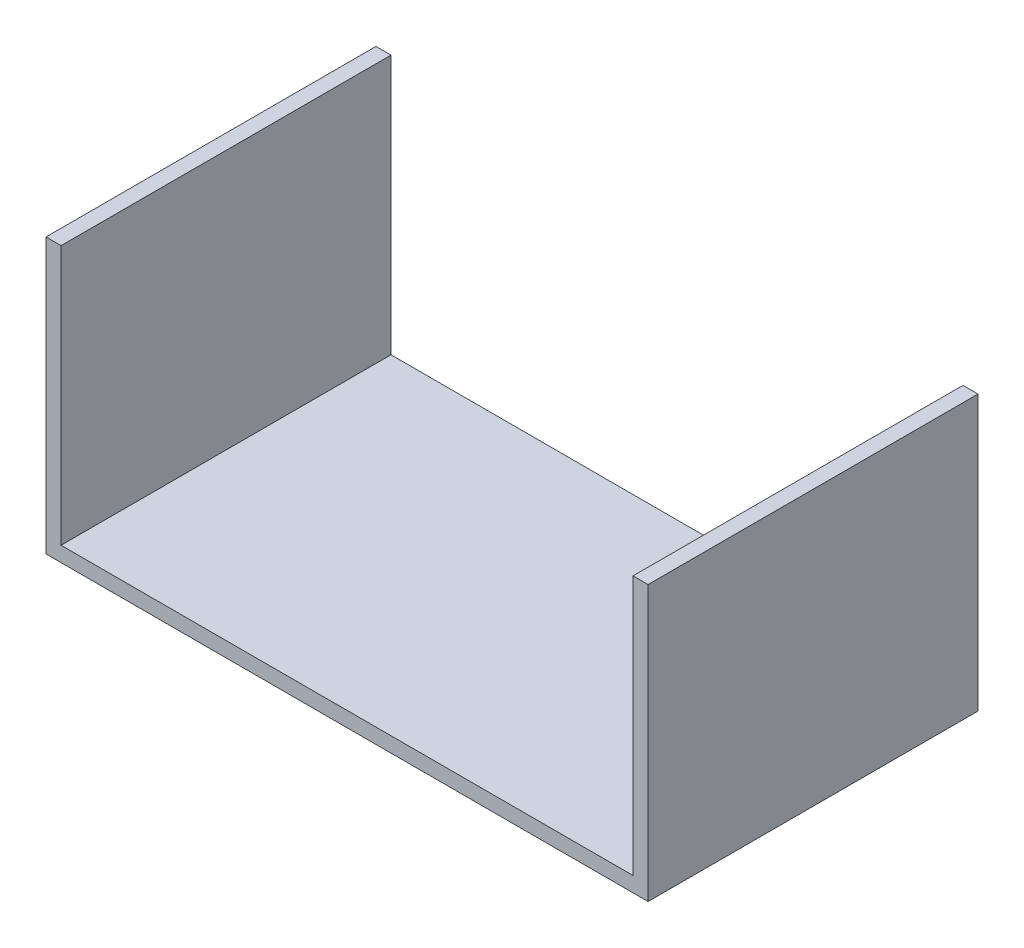
ISO-10303-21;
HEADER;
FILE_DESCRIPTION(('STEP AP214'),'2;1');
FILE_NAME('part.step','',(''),(''),'','','');
FILE_SCHEMA(('AUTOMOTIVE_DESIGN { 1 0 10303 214 1 1 1 1 }'));
ENDSEC;
DATA;
#1=APPLICATION_CONTEXT('core data for automotive mechanical design processes');
#2=APPLICATION_PROTOCOL_DEFINITION('international standard','automotive_design',2000,#1);
#3=PRODUCT_CONTEXT('',#1,'mechanical');
#4=PRODUCT('Part','Part','',(#3));
#5=PRODUCT_RELATED_PRODUCT_CATEGORY('part','',(#4));
#6=PRODUCT_DEFINITION_FORMATION('','',#4);
#7=PRODUCT_DEFINITION_CONTEXT('part definition',#1,'design');
#8=PRODUCT_DEFINITION('design','',#6,#7);
#9=PRODUCT_DEFINITION_SHAPE('','',#8);
#10=(LENGTH_UNIT() NAMED_UNIT(*) SI_UNIT(.MILLI.,.METRE.));
#11=(NAMED_UNIT(*) PLANE_ANGLE_UNIT() SI_UNIT($,.RADIAN.));
#12=(NAMED_UNIT(*) SI_UNIT($,.STERADIAN.) SOLID_ANGLE_UNIT());
#13=UNCERTAINTY_MEASURE_WITH_UNIT(LENGTH_MEASURE(1.E-05),#10,'distance_accuracy_value','');
#14=(GEOMETRIC_REPRESENTATION_CONTEXT(3) GLOBAL_UNCERTAINTY_ASSIGNED_CONTEXT((#13)) GLOBAL_UNIT_ASSIGNED_CONTEXT((#10,
#11,#12)) REPRESENTATION_CONTEXT('',''));
#15=CARTESIAN_POINT('',(0.,0.,0.));
#16=DIRECTION('',(0.,0.,1.));
#17=DIRECTION('',(1.,0.,0.));
#18=AXIS2_PLACEMENT_3D('',#15,#16,#17);
#19=CARTESIAN_POINT('',(0.,51.562,69.596));
#20=DIRECTION('',(-1.,0.,0.));
#21=DIRECTION('',(0.,0.,1.));
#22=AXIS2_PLACEMENT_3D('',#19,#20,#21);
#23=PLANE('',#22);
#24=DIRECTION('',(0.,1.,0.));
#25=VECTOR('',#24,1.);
#26=CARTESIAN_POINT('',(0.,51.562,0.));
#27=LINE('',#26,#25);
#28=CARTESIAN_POINT('',(0.,0.,0.));
#29=VERTEX_POINT('',#28);
#30=CARTESIAN_POINT('',(0.,54.737,0.));
#31=VERTEX_POINT('',#30);
#32=EDGE_CURVE('E88',#29,#31,#27,.T.);
#33=ORIENTED_EDGE('',*,*,#32,.T.);
#34=DIRECTION('',(0.,0.,-1.));
#35=VECTOR('',#34,1.);
#36=CARTESIAN_POINT('',(0.,54.737,69.596));
#37=LINE('',#36,#35);
#38=CARTESIAN_POINT('',(0.,54.737,69.596));
#39=VERTEX_POINT('',#38);
#40=EDGE_CURVE('E11',#39,#31,#37,.T.);
#41=ORIENTED_EDGE('',*,*,#40,.F.);
#42=DIRECTION('',(0.,1.,0.));
#43=VECTOR('',#42,1.);
#44=CARTESIAN_POINT('',(0.,0.,69.596));
#45=LINE('',#44,#43);
#46=CARTESIAN_POINT('',(0.,0.,69.596));
#47=VERTEX_POINT('',#46);
#48=EDGE_CURVE('E94',#47,#39,#45,.T.);
#49=ORIENTED_EDGE('',*,*,#48,.F.);
#50=DIRECTION('',(0.,0.,-1.));
#51=VECTOR('',#50,1.);
#52=CARTESIAN_POINT('',(0.,0.,69.596));
#53=LINE('',#52,#51);
#54=EDGE_CURVE('E128',#47,#29,#53,.T.);
#55=ORIENTED_EDGE('',*,*,#54,.T.);
#56=EDGE_LOOP('',(#33,#41,#49,#55));
#57=FACE_BOUND('',#56,.T.);
#58=ADVANCED_FACE('F36',(#57),#23,.F.);
#59=CARTESIAN_POINT('',(-3.175,54.737,69.596));
#60=DIRECTION('',(0.,-1.,0.));
#61=DIRECTION('',(0.,0.,-1.));
#62=AXIS2_PLACEMENT_3D('',#59,#60,#61);
#63=PLANE('',#62);
#64=DIRECTION('',(-1.,0.,0.));
#65=VECTOR('',#64,1.);
#66=CARTESIAN_POINT('',(-3.175,54.737,0.));
#67=LINE('',#66,#65);
#68=CARTESIAN_POINT('',(-3.175,54.737,0.));
#69=VERTEX_POINT('',#68);
#70=EDGE_CURVE('E133',#31,#69,#67,.T.);
#71=ORIENTED_EDGE('',*,*,#70,.T.);
#72=DIRECTION('',(0.,0.,-1.));
#73=VECTOR('',#72,1.);
#74=CARTESIAN_POINT('',(-3.175,54.737,69.596));
#75=LINE('',#74,#73);
#76=CARTESIAN_POINT('',(-3.175,54.737,69.596));
#77=VERTEX_POINT('',#76);
#78=EDGE_CURVE('E44',#77,#69,#75,.T.);
#79=ORIENTED_EDGE('',*,*,#78,.F.);
#80=DIRECTION('',(-1.,0.,0.));
#81=VECTOR('',#80,1.);
#82=CARTESIAN_POINT('',(-3.175,54.737,69.596));
#83=LINE('',#82,#81);
#84=EDGE_CURVE('E177',#39,#77,#83,.T.);
#85=ORIENTED_EDGE('',*,*,#84,.F.);
#86=ORIENTED_EDGE('',*,*,#40,.T.);
#87=EDGE_LOOP('',(#71,#79,#85,#86));
#88=FACE_BOUND('',#87,.T.);
#89=ADVANCED_FACE('F179',(#88),#63,.F.);
#90=CARTESIAN_POINT('',(-3.175,-3.175,69.596));
#91=DIRECTION('',(1.,0.,0.));
#92=DIRECTION('',(0.,0.,-1.));
#93=AXIS2_PLACEMENT_3D('',#90,#91,#92);
#94=PLANE('',#93);
#95=DIRECTION('',(0.,-1.,0.));
#96=VECTOR('',#95,1.);
#97=CARTESIAN_POINT('',(-3.175,-3.175,0.));
#98=LINE('',#97,#96);
#99=CARTESIAN_POINT('',(-3.175,-3.175,0.));
#100=VERTEX_POINT('',#99);
#101=EDGE_CURVE('E135',#69,#100,#98,.T.);
#102=ORIENTED_EDGE('',*,*,#101,.T.);
#103=DIRECTION('',(0.,0.,-1.));
#104=VECTOR('',#103,1.);
#105=CARTESIAN_POINT('',(-3.175,-3.175,69.596));
#106=LINE('',#105,#104);
#107=CARTESIAN_POINT('',(-3.175,-3.175,69.596));
#108=VERTEX_POINT('',#107);
#109=EDGE_CURVE('E152',#108,#100,#106,.T.);
#110=ORIENTED_EDGE('',*,*,#109,.F.);
#111=DIRECTION('',(0.,-1.,0.));
#112=VECTOR('',#111,1.);
#113=CARTESIAN_POINT('',(-3.175,-3.175,69.596));
#114=LINE('',#113,#112);
#115=EDGE_CURVE('E161',#77,#108,#114,.T.);
#116=ORIENTED_EDGE('',*,*,#115,.F.);
#117=ORIENTED_EDGE('',*,*,#78,.T.);
#118=EDGE_LOOP('',(#102,#110,#116,#117));
#119=FACE_BOUND('',#118,.T.);
#120=ADVANCED_FACE('F159',(#119),#94,.F.);
#121=CARTESIAN_POINT('',(-3.175,-3.175,69.596));
#122=DIRECTION('',(0.,1.,0.));
#123=DIRECTION('',(0.,0.,1.));
#124=AXIS2_PLACEMENT_3D('',#121,#122,#123);
#125=PLANE('',#124);
#126=DIRECTION('',(1.,0.,0.));
#127=VECTOR('',#126,1.);
#128=CARTESIAN_POINT('',(-3.175,-3.175,0.));
#129=LINE('',#128,#127);
#130=CARTESIAN_POINT('',(123.825,-3.175,0.));
#131=VERTEX_POINT('',#130);
#132=EDGE_CURVE('E137',#100,#131,#129,.T.);
#133=ORIENTED_EDGE('',*,*,#132,.T.);
#134=DIRECTION('',(0.,0.,-1.));
#135=VECTOR('',#134,1.);
#136=CARTESIAN_POINT('',(123.825,-3.175,69.596));
#137=LINE('',#136,#135);
#138=CARTESIAN_POINT('',(123.825,-3.175,69.596));
#139=VERTEX_POINT('',#138);
#140=EDGE_CURVE('E149',#139,#131,#137,.T.);
#141=ORIENTED_EDGE('',*,*,#140,.F.);
#142=DIRECTION('',(1.,0.,0.));
#143=VECTOR('',#142,1.);
#144=CARTESIAN_POINT('',(-3.175,-3.175,69.596));
#145=LINE('',#144,#143);
#146=EDGE_CURVE('E173',#108,#139,#145,.T.);
#147=ORIENTED_EDGE('',*,*,#146,.F.);
#148=ORIENTED_EDGE('',*,*,#109,.T.);
#149=EDGE_LOOP('',(#133,#141,#147,#148));
#150=FACE_BOUND('',#149,.T.);
#151=ADVANCED_FACE('F169',(#150),#125,.F.);
#152=CARTESIAN_POINT('',(123.825,-3.175,69.596));
#153=DIRECTION('',(-1.,0.,0.));
#154=DIRECTION('',(0.,0.,1.));
#155=AXIS2_PLACEMENT_3D('',#152,#153,#154);
#156=PLANE('',#155);
#157=DIRECTION('',(0.,1.,0.));
#158=VECTOR('',#157,1.);
#159=CARTESIAN_POINT('',(123.825,-3.175,0.));
#160=LINE('',#159,#158);
#161=CARTESIAN_POINT('',(123.825,54.737,0.));
#162=VERTEX_POINT('',#161);
#163=EDGE_CURVE('E139',#131,#162,#160,.T.);
#164=ORIENTED_EDGE('',*,*,#163,.T.);
#165=DIRECTION('',(0.,0.,-1.));
#166=VECTOR('',#165,1.);
#167=CARTESIAN_POINT('',(123.825,54.737,69.596));
#168=LINE('',#167,#166);
#169=CARTESIAN_POINT('',(123.825,54.737,69.596));
#170=VERTEX_POINT('',#169);
#171=EDGE_CURVE('E123',#170,#162,#168,.T.);
#172=ORIENTED_EDGE('',*,*,#171,.F.);
#173=DIRECTION('',(0.,1.,0.));
#174=VECTOR('',#173,1.);
#175=CARTESIAN_POINT('',(123.825,-3.175,69.596));
#176=LINE('',#175,#174);
#177=EDGE_CURVE('E114',#139,#170,#176,.T.);
#178=ORIENTED_EDGE('',*,*,#177,.F.);
#179=ORIENTED_EDGE('',*,*,#140,.T.);
#180=EDGE_LOOP('',(#164,#172,#178,#179));
#181=FACE_BOUND('',#180,.T.);
#182=ADVANCED_FACE('F172',(#181),#156,.F.);
#183=CARTESIAN_POINT('',(123.825,54.737,69.596));
#184=DIRECTION('',(0.,-1.,0.));
#185=DIRECTION('',(1.,0.,0.));
#186=AXIS2_PLACEMENT_3D('',#183,#184,#185);
#187=PLANE('',#186);
#188=DIRECTION('',(-1.,0.,0.));
#189=VECTOR('',#188,1.);
#190=CARTESIAN_POINT('',(123.825,54.737,0.));
#191=LINE('',#190,#189);
#192=CARTESIAN_POINT('',(120.65,54.737,0.));
#193=VERTEX_POINT('',#192);
#194=EDGE_CURVE('E122',#162,#193,#191,.T.);
#195=ORIENTED_EDGE('',*,*,#194,.T.);
#196=DIRECTION('',(0.,0.,-1.));
#197=VECTOR('',#196,1.);
#198=CARTESIAN_POINT('',(120.65,54.737,69.596));
#199=LINE('',#198,#197);
#200=CARTESIAN_POINT('',(120.65,54.737,69.596));
#201=VERTEX_POINT('',#200);
#202=EDGE_CURVE('E119',#201,#193,#199,.T.);
#203=ORIENTED_EDGE('',*,*,#202,.F.);
#204=DIRECTION('',(-1.,0.,0.));
#205=VECTOR('',#204,1.);
#206=CARTESIAN_POINT('',(123.825,54.737,69.596));
#207=LINE('',#206,#205);
#208=EDGE_CURVE('E108',#170,#201,#207,.T.);
#209=ORIENTED_EDGE('',*,*,#208,.F.);
#210=ORIENTED_EDGE('',*,*,#171,.T.);
#211=EDGE_LOOP('',(#195,#203,#209,#210));
#212=FACE_BOUND('',#211,.T.);
#213=ADVANCED_FACE('F120',(#212),#187,.F.);
#214=CARTESIAN_POINT('',(120.65,54.737,69.596));
#215=DIRECTION('',(1.,0.,0.));
#216=DIRECTION('',(0.,0.,-1.));
#217=AXIS2_PLACEMENT_3D('',#214,#215,#216);
#218=PLANE('',#217);
#219=DIRECTION('',(0.,-1.,0.));
#220=VECTOR('',#219,1.);
#221=CARTESIAN_POINT('',(120.65,54.737,0.));
#222=LINE('',#221,#220);
#223=CARTESIAN_POINT('',(120.65,0.,0.));
#224=VERTEX_POINT('',#223);
#225=EDGE_CURVE('E81',#193,#224,#222,.T.);
#226=ORIENTED_EDGE('',*,*,#225,.T.);
#227=DIRECTION('',(0.,0.,-1.));
#228=VECTOR('',#227,1.);
#229=CARTESIAN_POINT('',(120.65,0.,69.596));
#230=LINE('',#229,#228);
#231=CARTESIAN_POINT('',(120.65,0.,69.596));
#232=VERTEX_POINT('',#231);
#233=EDGE_CURVE('E124',#232,#224,#230,.T.);
#234=ORIENTED_EDGE('',*,*,#233,.F.);
#235=DIRECTION('',(0.,-1.,0.));
#236=VECTOR('',#235,1.);
#237=CARTESIAN_POINT('',(120.65,54.737,69.596));
#238=LINE('',#237,#236);
#239=EDGE_CURVE('E112',#201,#232,#238,.T.);
#240=ORIENTED_EDGE('',*,*,#239,.F.);
#241=ORIENTED_EDGE('',*,*,#202,.T.);
#242=EDGE_LOOP('',(#226,#234,#240,#241));
#243=FACE_BOUND('',#242,.T.);
#244=ADVANCED_FACE('F126',(#243),#218,.F.);
#245=CARTESIAN_POINT('',(0.,0.,69.596));
#246=DIRECTION('',(0.,-1.,0.));
#247=DIRECTION('',(0.,0.,-1.));
#248=AXIS2_PLACEMENT_3D('',#245,#246,#247);
#249=PLANE('',#248);
#250=DIRECTION('',(-1.,0.,0.));
#251=VECTOR('',#250,1.);
#252=CARTESIAN_POINT('',(0.,0.,0.));
#253=LINE('',#252,#251);
#254=EDGE_CURVE('E143',#224,#29,#253,.T.);
#255=ORIENTED_EDGE('',*,*,#254,.T.);
#256=ORIENTED_EDGE('',*,*,#54,.F.);
#257=DIRECTION('',(-1.,0.,0.));
#258=VECTOR('',#257,1.);
#259=CARTESIAN_POINT('',(0.,0.,69.596));
#260=LINE('',#259,#258);
#261=EDGE_CURVE('E52',#232,#47,#260,.T.);
#262=ORIENTED_EDGE('',*,*,#261,.F.);
#263=ORIENTED_EDGE('',*,*,#233,.T.);
#264=EDGE_LOOP('',(#255,#256,#262,#263));
#265=FACE_BOUND('',#264,.T.);
#266=ADVANCED_FACE('F182',(#265),#249,.F.);
#267=CARTESIAN_POINT('',(0.,0.,69.596));
#268=DIRECTION('',(0.,0.,-1.));
#269=DIRECTION('',(-1.,0.,0.));
#270=AXIS2_PLACEMENT_3D('',#267,#268,#269);
#271=PLANE('',#270);
#272=ORIENTED_EDGE('',*,*,#48,.T.);
#273=ORIENTED_EDGE('',*,*,#84,.T.);
#274=ORIENTED_EDGE('',*,*,#115,.T.);
#275=ORIENTED_EDGE('',*,*,#146,.T.);
#276=ORIENTED_EDGE('',*,*,#177,.T.);
#277=ORIENTED_EDGE('',*,*,#208,.T.);
#278=ORIENTED_EDGE('',*,*,#239,.T.);
#279=ORIENTED_EDGE('',*,*,#261,.T.);
#280=EDGE_LOOP('',(#272,#273,#274,#275,#276,#277,#278,#279));
#281=FACE_BOUND('',#280,.T.);
#282=ADVANCED_FACE('F110',(#281),#271,.F.);
#283=CARTESIAN_POINT('',(0.,0.,0.));
#284=DIRECTION('',(0.,0.,-1.));
#285=DIRECTION('',(-1.,0.,0.));
#286=AXIS2_PLACEMENT_3D('',#283,#284,#285);
#287=PLANE('',#286);
#288=ORIENTED_EDGE('',*,*,#32,.F.);
#289=ORIENTED_EDGE('',*,*,#254,.F.);
#290=ORIENTED_EDGE('',*,*,#225,.F.);
#291=ORIENTED_EDGE('',*,*,#194,.F.);
#292=ORIENTED_EDGE('',*,*,#163,.F.);
#293=ORIENTED_EDGE('',*,*,#132,.F.);
#294=ORIENTED_EDGE('',*,*,#101,.F.);
#295=ORIENTED_EDGE('',*,*,#70,.F.);
#296=EDGE_LOOP('',(#288,#289,#290,#291,#292,#293,#294,#295));
#297=FACE_BOUND('',#296,.T.);
#298=ADVANCED_FACE('F165',(#297),#287,.T.);
#299=CLOSED_SHELL('',(#58,#89,#120,#151,#182,#213,#244,#266,#282,#298));
#300=MANIFOLD_SOLID_BREP('B2',#299);
#301=ADVANCED_BREP_SHAPE_REPRESENTATION('',(#18,#300),#14);
#302=SHAPE_DEFINITION_REPRESENTATION(#9,#301);
ENDSEC;
END-ISO-10303-21;
